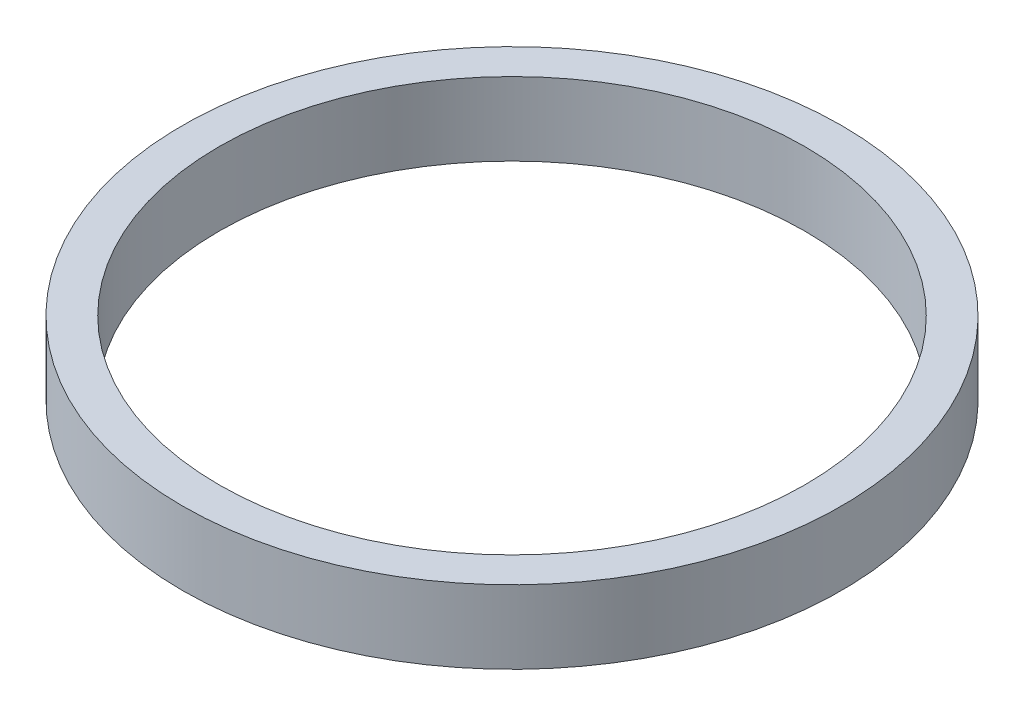
ISO-10303-21;
HEADER;
FILE_DESCRIPTION(('STEP AP214'),'2;1');
FILE_NAME('part.step','',(''),(''),'','','');
FILE_SCHEMA(('AUTOMOTIVE_DESIGN { 1 0 10303 214 1 1 1 1 }'));
ENDSEC;
DATA;
#1=APPLICATION_CONTEXT('core data for automotive mechanical design processes');
#2=APPLICATION_PROTOCOL_DEFINITION('international standard','automotive_design',2000,#1);
#3=PRODUCT_CONTEXT('',#1,'mechanical');
#4=PRODUCT('Part','Part','',(#3));
#5=PRODUCT_RELATED_PRODUCT_CATEGORY('part','',(#4));
#6=PRODUCT_DEFINITION_FORMATION('','',#4);
#7=PRODUCT_DEFINITION_CONTEXT('part definition',#1,'design');
#8=PRODUCT_DEFINITION('design','',#6,#7);
#9=PRODUCT_DEFINITION_SHAPE('','',#8);
#10=(LENGTH_UNIT() NAMED_UNIT(*) SI_UNIT(.MILLI.,.METRE.));
#11=(NAMED_UNIT(*) PLANE_ANGLE_UNIT() SI_UNIT($,.RADIAN.));
#12=(NAMED_UNIT(*) SI_UNIT($,.STERADIAN.) SOLID_ANGLE_UNIT());
#13=UNCERTAINTY_MEASURE_WITH_UNIT(LENGTH_MEASURE(1.E-05),#10,'distance_accuracy_value','');
#14=(GEOMETRIC_REPRESENTATION_CONTEXT(3) GLOBAL_UNCERTAINTY_ASSIGNED_CONTEXT((#13)) GLOBAL_UNIT_ASSIGNED_CONTEXT((#10,
#11,#12)) REPRESENTATION_CONTEXT('',''));
#15=CARTESIAN_POINT('',(0.,0.,0.));
#16=DIRECTION('',(0.,0.,1.));
#17=DIRECTION('',(1.,0.,0.));
#18=AXIS2_PLACEMENT_3D('',#15,#16,#17);
#19=CARTESIAN_POINT('',(0.,10.,0.));
#20=DIRECTION('',(0.,-1.,0.));
#21=DIRECTION('',(0.,0.,-1.));
#22=AXIS2_PLACEMENT_3D('',#19,#20,#21);
#23=CYLINDRICAL_SURFACE('',#22,45.);
#24=CARTESIAN_POINT('',(0.,10.,0.));
#25=DIRECTION('',(0.,1.,0.));
#26=DIRECTION('',(0.,0.,1.));
#27=AXIS2_PLACEMENT_3D('',#24,#25,#26);
#28=CIRCLE('',#27,45.);
#29=CARTESIAN_POINT('',(0.,10.,45.));
#30=VERTEX_POINT('',#29);
#31=EDGE_CURVE('E10',#30,#30,#28,.T.);
#32=ORIENTED_EDGE('',*,*,#31,.F.);
#33=EDGE_LOOP('',(#32));
#34=FACE_BOUND('',#33,.T.);
#35=CARTESIAN_POINT('',(0.,0.,0.));
#36=DIRECTION('',(0.,1.,0.));
#37=DIRECTION('',(0.,0.,1.));
#38=AXIS2_PLACEMENT_3D('',#35,#36,#37);
#39=CIRCLE('',#38,45.);
#40=CARTESIAN_POINT('',(0.,0.,45.));
#41=VERTEX_POINT('',#40);
#42=EDGE_CURVE('E46',#41,#41,#39,.T.);
#43=ORIENTED_EDGE('',*,*,#42,.T.);
#44=EDGE_LOOP('',(#43));
#45=FACE_BOUND('',#44,.T.);
#46=ADVANCED_FACE('F43',(#34,#45),#23,.T.);
#47=CARTESIAN_POINT('',(0.,10.,0.));
#48=DIRECTION('',(0.,1.,0.));
#49=DIRECTION('',(0.,0.,1.));
#50=AXIS2_PLACEMENT_3D('',#47,#48,#49);
#51=PLANE('',#50);
#52=CARTESIAN_POINT('',(0.,10.,0.));
#53=DIRECTION('',(0.,1.,0.));
#54=DIRECTION('',(0.,0.,1.));
#55=AXIS2_PLACEMENT_3D('',#52,#53,#54);
#56=CIRCLE('',#55,40.);
#57=CARTESIAN_POINT('',(0.,10.,40.));
#58=VERTEX_POINT('',#57);
#59=EDGE_CURVE('E57',#58,#58,#56,.T.);
#60=ORIENTED_EDGE('',*,*,#59,.F.);
#61=EDGE_LOOP('',(#60));
#62=FACE_BOUND('',#61,.T.);
#63=ORIENTED_EDGE('',*,*,#31,.T.);
#64=EDGE_LOOP('',(#63));
#65=FACE_BOUND('',#64,.T.);
#66=ADVANCED_FACE('F74',(#62,#65),#51,.T.);
#67=CARTESIAN_POINT('',(0.,0.,0.));
#68=DIRECTION('',(0.,1.,0.));
#69=DIRECTION('',(0.,0.,1.));
#70=AXIS2_PLACEMENT_3D('',#67,#68,#69);
#71=PLANE('',#70);
#72=CARTESIAN_POINT('',(0.,0.,0.));
#73=DIRECTION('',(0.,1.,0.));
#74=DIRECTION('',(0.,0.,1.));
#75=AXIS2_PLACEMENT_3D('',#72,#73,#74);
#76=CIRCLE('',#75,40.);
#77=CARTESIAN_POINT('',(0.,0.,40.));
#78=VERTEX_POINT('',#77);
#79=EDGE_CURVE('E55',#78,#78,#76,.T.);
#80=ORIENTED_EDGE('',*,*,#79,.T.);
#81=EDGE_LOOP('',(#80));
#82=FACE_BOUND('',#81,.T.);
#83=ORIENTED_EDGE('',*,*,#42,.F.);
#84=EDGE_LOOP('',(#83));
#85=FACE_BOUND('',#84,.T.);
#86=ADVANCED_FACE('F65',(#82,#85),#71,.F.);
#87=CARTESIAN_POINT('',(0.,0.,0.));
#88=DIRECTION('',(0.,1.,0.));
#89=DIRECTION('',(0.,0.,1.));
#90=AXIS2_PLACEMENT_3D('',#87,#88,#89);
#91=CYLINDRICAL_SURFACE('',#90,40.);
#92=ORIENTED_EDGE('',*,*,#79,.F.);
#93=EDGE_LOOP('',(#92));
#94=FACE_BOUND('',#93,.T.);
#95=ORIENTED_EDGE('',*,*,#59,.T.);
#96=EDGE_LOOP('',(#95));
#97=FACE_BOUND('',#96,.T.);
#98=ADVANCED_FACE('F68',(#94,#97),#91,.F.);
#99=CLOSED_SHELL('',(#46,#66,#86,#98));
#100=MANIFOLD_SOLID_BREP('B2',#99);
#101=ADVANCED_BREP_SHAPE_REPRESENTATION('',(#18,#100),#14);
#102=SHAPE_DEFINITION_REPRESENTATION(#9,#101);
ENDSEC;
END-ISO-10303-21;
